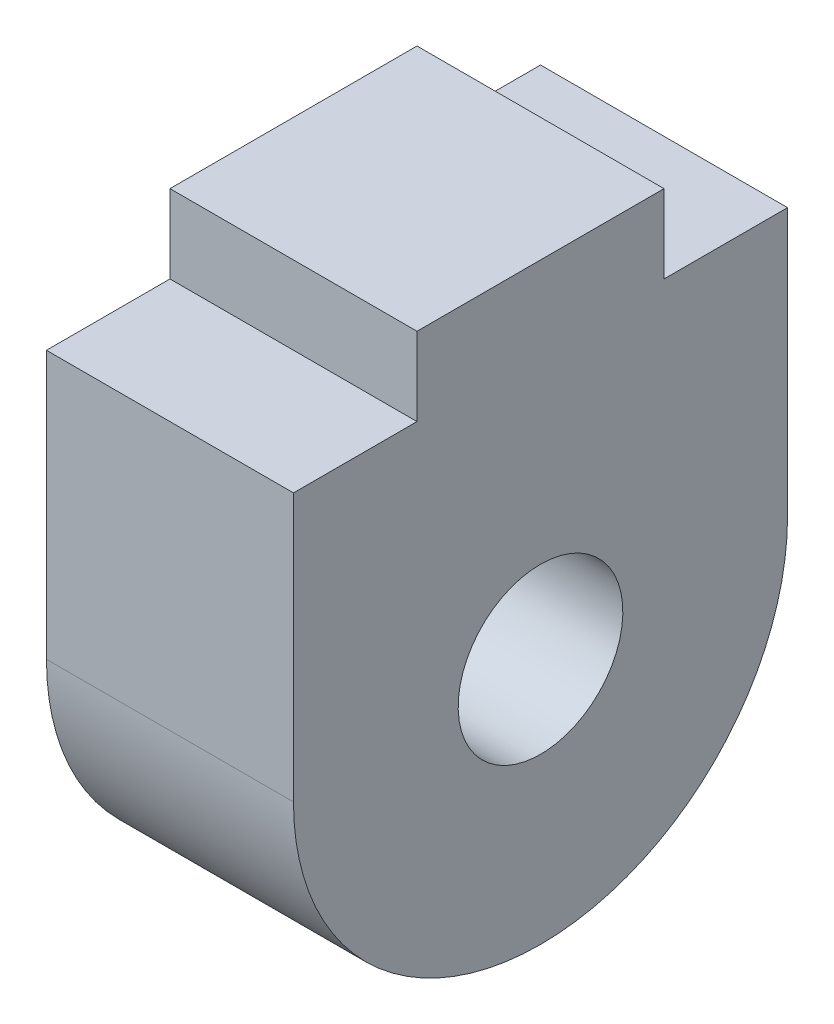
ISO-10303-21;
HEADER;
FILE_DESCRIPTION(('STEP AP214'),'2;1');
FILE_NAME('part.step','',(''),(''),'','','');
FILE_SCHEMA(('AUTOMOTIVE_DESIGN { 1 0 10303 214 1 1 1 1 }'));
ENDSEC;
DATA;
#1=APPLICATION_CONTEXT('core data for automotive mechanical design processes');
#2=APPLICATION_PROTOCOL_DEFINITION('international standard','automotive_design',2000,#1);
#3=PRODUCT_CONTEXT('',#1,'mechanical');
#4=PRODUCT('Part','Part','',(#3));
#5=PRODUCT_RELATED_PRODUCT_CATEGORY('part','',(#4));
#6=PRODUCT_DEFINITION_FORMATION('','',#4);
#7=PRODUCT_DEFINITION_CONTEXT('part definition',#1,'design');
#8=PRODUCT_DEFINITION('design','',#6,#7);
#9=PRODUCT_DEFINITION_SHAPE('','',#8);
#10=(LENGTH_UNIT() NAMED_UNIT(*) SI_UNIT(.MILLI.,.METRE.));
#11=(NAMED_UNIT(*) PLANE_ANGLE_UNIT() SI_UNIT($,.RADIAN.));
#12=(NAMED_UNIT(*) SI_UNIT($,.STERADIAN.) SOLID_ANGLE_UNIT());
#13=UNCERTAINTY_MEASURE_WITH_UNIT(LENGTH_MEASURE(1.E-05),#10,'distance_accuracy_value','');
#14=(GEOMETRIC_REPRESENTATION_CONTEXT(3) GLOBAL_UNCERTAINTY_ASSIGNED_CONTEXT((#13)) GLOBAL_UNIT_ASSIGNED_CONTEXT((#10,
#11,#12)) REPRESENTATION_CONTEXT('',''));
#15=CARTESIAN_POINT('',(0.,0.,0.));
#16=DIRECTION('',(0.,0.,1.));
#17=DIRECTION('',(1.,0.,0.));
#18=AXIS2_PLACEMENT_3D('',#15,#16,#17);
#19=CARTESIAN_POINT('',(0.,6.5,0.));
#20=DIRECTION('',(0.,-1.,0.));
#21=DIRECTION('',(0.,0.,-1.));
#22=AXIS2_PLACEMENT_3D('',#19,#20,#21);
#23=PLANE('',#22);
#24=DIRECTION('',(1.,0.,0.));
#25=VECTOR('',#24,1.);
#26=CARTESIAN_POINT('',(3.,6.5,-89.5));
#27=LINE('',#26,#25);
#28=CARTESIAN_POINT('',(-3.,6.5,-89.5));
#29=VERTEX_POINT('',#28);
#30=CARTESIAN_POINT('',(3.,6.5,-89.5));
#31=VERTEX_POINT('',#30);
#32=EDGE_CURVE('E129',#29,#31,#27,.T.);
#33=ORIENTED_EDGE('',*,*,#32,.F.);
#34=DIRECTION('',(0.,0.,1.));
#35=VECTOR('',#34,1.);
#36=CARTESIAN_POINT('',(-3.,6.49999999999999,0.));
#37=LINE('',#36,#35);
#38=CARTESIAN_POINT('',(-3.,6.5,-86.4999999999999));
#39=VERTEX_POINT('',#38);
#40=EDGE_CURVE('E53',#29,#39,#37,.T.);
#41=ORIENTED_EDGE('',*,*,#40,.T.);
#42=DIRECTION('',(-1.,0.,0.));
#43=VECTOR('',#42,1.);
#44=CARTESIAN_POINT('',(20.3277234511636,6.5,-86.4999999999999));
#45=LINE('',#44,#43);
#46=CARTESIAN_POINT('',(3.,6.5,-86.4999999999999));
#47=VERTEX_POINT('',#46);
#48=EDGE_CURVE('E155',#47,#39,#45,.T.);
#49=ORIENTED_EDGE('',*,*,#48,.F.);
#50=DIRECTION('',(0.,0.,1.));
#51=VECTOR('',#50,1.);
#52=CARTESIAN_POINT('',(3.,6.49999999999999,0.));
#53=LINE('',#52,#51);
#54=EDGE_CURVE('E61',#31,#47,#53,.T.);
#55=ORIENTED_EDGE('',*,*,#54,.F.);
#56=EDGE_LOOP('',(#33,#41,#49,#55));
#57=FACE_BOUND('',#56,.T.);
#58=ADVANCED_FACE('F45',(#57),#23,.F.);
#59=DIRECTION('',(-1.,0.,0.));
#60=VECTOR('',#59,1.);
#61=CARTESIAN_POINT('',(3.,6.5,-95.5));
#62=LINE('',#61,#60);
#63=CARTESIAN_POINT('',(3.,6.5,-95.5));
#64=VERTEX_POINT('',#63);
#65=CARTESIAN_POINT('',(-3.,6.5,-95.5));
#66=VERTEX_POINT('',#65);
#67=EDGE_CURVE('E68',#64,#66,#62,.T.);
#68=ORIENTED_EDGE('',*,*,#67,.F.);
#69=CARTESIAN_POINT('',(3.,6.5,-98.5000000000001));
#70=VERTEX_POINT('',#69);
#71=EDGE_CURVE('E134',#70,#64,#53,.T.);
#72=ORIENTED_EDGE('',*,*,#71,.F.);
#73=DIRECTION('',(-1.,0.,0.));
#74=VECTOR('',#73,1.);
#75=CARTESIAN_POINT('',(20.3277234511636,6.5,-98.5000000000001));
#76=LINE('',#75,#74);
#77=CARTESIAN_POINT('',(-3.,6.5,-98.5000000000001));
#78=VERTEX_POINT('',#77);
#79=EDGE_CURVE('E158',#70,#78,#76,.T.);
#80=ORIENTED_EDGE('',*,*,#79,.T.);
#81=EDGE_CURVE('E11',#78,#66,#37,.T.);
#82=ORIENTED_EDGE('',*,*,#81,.T.);
#83=EDGE_LOOP('',(#68,#72,#80,#82));
#84=FACE_BOUND('',#83,.T.);
#85=ADVANCED_FACE('F204',(#84),#23,.F.);
#86=CARTESIAN_POINT('',(20.3277234511636,0.,-92.5));
#87=DIRECTION('',(-1.,0.,0.));
#88=DIRECTION('',(0.,0.,1.));
#89=AXIS2_PLACEMENT_3D('',#86,#87,#88);
#90=CYLINDRICAL_SURFACE('',#89,2.);
#91=CARTESIAN_POINT('',(3.,0.,-92.5));
#92=DIRECTION('',(1.,0.,0.));
#93=DIRECTION('',(0.,1.,0.));
#94=AXIS2_PLACEMENT_3D('',#91,#92,#93);
#95=CIRCLE('',#94,2.);
#96=CARTESIAN_POINT('',(3.,2.00000000000003,-92.5));
#97=VERTEX_POINT('',#96);
#98=EDGE_CURVE('E152',#97,#97,#95,.T.);
#99=ORIENTED_EDGE('',*,*,#98,.T.);
#100=EDGE_LOOP('',(#99));
#101=FACE_BOUND('',#100,.T.);
#102=CARTESIAN_POINT('',(-3.,0.,-92.5));
#103=DIRECTION('',(-1.,0.,0.));
#104=DIRECTION('',(0.,-1.,0.));
#105=AXIS2_PLACEMENT_3D('',#102,#103,#104);
#106=CIRCLE('',#105,2.);
#107=CARTESIAN_POINT('',(-3.,-1.99999999999996,-92.5));
#108=VERTEX_POINT('',#107);
#109=EDGE_CURVE('E147',#108,#108,#106,.F.);
#110=ORIENTED_EDGE('',*,*,#109,.F.);
#111=EDGE_LOOP('',(#110));
#112=FACE_BOUND('',#111,.T.);
#113=ADVANCED_FACE('F202',(#101,#112),#90,.F.);
#114=CARTESIAN_POINT('',(20.3277234511636,0.,-98.5000000000001));
#115=DIRECTION('',(0.,0.,1.));
#116=DIRECTION('',(1.,0.,0.));
#117=AXIS2_PLACEMENT_3D('',#114,#115,#116);
#118=PLANE('',#117);
#119=DIRECTION('',(0.,1.,0.));
#120=VECTOR('',#119,1.);
#121=CARTESIAN_POINT('',(3.,0.,-98.5000000000001));
#122=LINE('',#121,#120);
#123=CARTESIAN_POINT('',(3.,0.,-98.5000000000001));
#124=VERTEX_POINT('',#123);
#125=EDGE_CURVE('E159',#124,#70,#122,.T.);
#126=ORIENTED_EDGE('',*,*,#125,.F.);
#127=DIRECTION('',(-1.,0.,0.));
#128=VECTOR('',#127,1.);
#129=CARTESIAN_POINT('',(20.3277234511636,0.,-98.5000000000001));
#130=LINE('',#129,#128);
#131=CARTESIAN_POINT('',(-3.,0.,-98.5000000000001));
#132=VERTEX_POINT('',#131);
#133=EDGE_CURVE('E156',#124,#132,#130,.T.);
#134=ORIENTED_EDGE('',*,*,#133,.T.);
#135=DIRECTION('',(0.,1.,0.));
#136=VECTOR('',#135,1.);
#137=CARTESIAN_POINT('',(-3.,0.,-98.5000000000001));
#138=LINE('',#137,#136);
#139=EDGE_CURVE('E146',#132,#78,#138,.T.);
#140=ORIENTED_EDGE('',*,*,#139,.T.);
#141=ORIENTED_EDGE('',*,*,#79,.F.);
#142=EDGE_LOOP('',(#126,#134,#140,#141));
#143=FACE_BOUND('',#142,.T.);
#144=ADVANCED_FACE('F213',(#143),#118,.F.);
#145=CARTESIAN_POINT('',(20.3277234511636,-1.84681330057839E-13,-86.4999999999999));
#146=DIRECTION('',(0.,0.,-1.));
#147=DIRECTION('',(0.,1.,0.));
#148=AXIS2_PLACEMENT_3D('',#145,#146,#147);
#149=PLANE('',#148);
#150=DIRECTION('',(0.,-1.,0.));
#151=VECTOR('',#150,1.);
#152=CARTESIAN_POINT('',(3.,-1.84681326707616E-13,-86.4999999999999));
#153=LINE('',#152,#151);
#154=CARTESIAN_POINT('',(3.,0.,-86.4999999999999));
#155=VERTEX_POINT('',#154);
#156=EDGE_CURVE('E164',#47,#155,#153,.T.);
#157=ORIENTED_EDGE('',*,*,#156,.F.);
#158=ORIENTED_EDGE('',*,*,#48,.T.);
#159=DIRECTION('',(0.,-1.,0.));
#160=VECTOR('',#159,1.);
#161=CARTESIAN_POINT('',(-3.,-1.84681333408062E-13,-86.4999999999999));
#162=LINE('',#161,#160);
#163=CARTESIAN_POINT('',(-3.,0.,-86.4999999999999));
#164=VERTEX_POINT('',#163);
#165=EDGE_CURVE('E135',#39,#164,#162,.T.);
#166=ORIENTED_EDGE('',*,*,#165,.T.);
#167=DIRECTION('',(-1.,0.,0.));
#168=VECTOR('',#167,1.);
#169=CARTESIAN_POINT('',(20.3277234511636,0.,-86.4999999999999));
#170=LINE('',#169,#168);
#171=EDGE_CURVE('E48',#155,#164,#170,.T.);
#172=ORIENTED_EDGE('',*,*,#171,.F.);
#173=EDGE_LOOP('',(#157,#158,#166,#172));
#174=FACE_BOUND('',#173,.T.);
#175=ADVANCED_FACE('F172',(#174),#149,.F.);
#176=CARTESIAN_POINT('',(20.3277234511636,0.,-92.5));
#177=DIRECTION('',(-1.,0.,0.));
#178=DIRECTION('',(0.,0.,1.));
#179=AXIS2_PLACEMENT_3D('',#176,#177,#178);
#180=CYLINDRICAL_SURFACE('',#179,6.00000000000009);
#181=CARTESIAN_POINT('',(3.,0.,-92.5));
#182=DIRECTION('',(1.,0.,0.));
#183=DIRECTION('',(0.,1.,0.));
#184=AXIS2_PLACEMENT_3D('',#181,#182,#183);
#185=CIRCLE('',#184,6.00000000000009);
#186=EDGE_CURVE('E161',#155,#124,#185,.T.);
#187=ORIENTED_EDGE('',*,*,#186,.F.);
#188=ORIENTED_EDGE('',*,*,#171,.T.);
#189=CARTESIAN_POINT('',(-3.,0.,-92.5));
#190=DIRECTION('',(-1.,0.,0.));
#191=DIRECTION('',(0.,-1.,0.));
#192=AXIS2_PLACEMENT_3D('',#189,#190,#191);
#193=CIRCLE('',#192,6.00000000000009);
#194=EDGE_CURVE('E138',#164,#132,#193,.F.);
#195=ORIENTED_EDGE('',*,*,#194,.T.);
#196=ORIENTED_EDGE('',*,*,#133,.F.);
#197=EDGE_LOOP('',(#187,#188,#195,#196));
#198=FACE_BOUND('',#197,.T.);
#199=ADVANCED_FACE('F184',(#198),#180,.T.);
#200=CARTESIAN_POINT('',(-3.,-108.342189385777,-73.4744908321675));
#201=DIRECTION('',(-1.,0.,0.));
#202=DIRECTION('',(0.,0.984928994416215,-0.172959174252955));
#203=AXIS2_PLACEMENT_3D('',#200,#201,#202);
#204=PLANE('',#203);
#205=ORIENTED_EDGE('',*,*,#194,.F.);
#206=ORIENTED_EDGE('',*,*,#165,.F.);
#207=ORIENTED_EDGE('',*,*,#40,.F.);
#208=DIRECTION('',(0.,-1.,0.));
#209=VECTOR('',#208,1.);
#210=CARTESIAN_POINT('',(-3.,8.4,-89.5));
#211=LINE('',#210,#209);
#212=CARTESIAN_POINT('',(-3.,8.4,-89.5));
#213=VERTEX_POINT('',#212);
#214=EDGE_CURVE('E140',#213,#29,#211,.T.);
#215=ORIENTED_EDGE('',*,*,#214,.F.);
#216=DIRECTION('',(0.,0.,1.));
#217=VECTOR('',#216,1.);
#218=CARTESIAN_POINT('',(-3.,8.4,-89.5));
#219=LINE('',#218,#217);
#220=CARTESIAN_POINT('',(-3.,8.4,-95.5));
#221=VERTEX_POINT('',#220);
#222=EDGE_CURVE('E119',#221,#213,#219,.T.);
#223=ORIENTED_EDGE('',*,*,#222,.F.);
#224=DIRECTION('',(0.,-1.,0.));
#225=VECTOR('',#224,1.);
#226=CARTESIAN_POINT('',(-3.,8.4,-95.5));
#227=LINE('',#226,#225);
#228=EDGE_CURVE('E116',#221,#66,#227,.T.);
#229=ORIENTED_EDGE('',*,*,#228,.T.);
#230=ORIENTED_EDGE('',*,*,#81,.F.);
#231=ORIENTED_EDGE('',*,*,#139,.F.);
#232=EDGE_LOOP('',(#205,#206,#207,#215,#223,#229,#230,#231));
#233=FACE_BOUND('',#232,.T.);
#234=ORIENTED_EDGE('',*,*,#109,.T.);
#235=EDGE_LOOP('',(#234));
#236=FACE_BOUND('',#235,.T.);
#237=ADVANCED_FACE('F176',(#233,#236),#204,.T.);
#238=CARTESIAN_POINT('',(3.,-108.342189385777,-73.4744908321675));
#239=DIRECTION('',(1.,0.,0.));
#240=DIRECTION('',(0.,0.984928994416215,-0.172959174252955));
#241=AXIS2_PLACEMENT_3D('',#238,#239,#240);
#242=PLANE('',#241);
#243=ORIENTED_EDGE('',*,*,#98,.F.);
#244=EDGE_LOOP('',(#243));
#245=FACE_BOUND('',#244,.T.);
#246=ORIENTED_EDGE('',*,*,#156,.T.);
#247=ORIENTED_EDGE('',*,*,#186,.T.);
#248=ORIENTED_EDGE('',*,*,#125,.T.);
#249=ORIENTED_EDGE('',*,*,#71,.T.);
#250=DIRECTION('',(0.,-1.,0.));
#251=VECTOR('',#250,1.);
#252=CARTESIAN_POINT('',(3.,8.4,-95.5));
#253=LINE('',#252,#251);
#254=CARTESIAN_POINT('',(3.,8.4,-95.5));
#255=VERTEX_POINT('',#254);
#256=EDGE_CURVE('E114',#255,#64,#253,.T.);
#257=ORIENTED_EDGE('',*,*,#256,.F.);
#258=DIRECTION('',(0.,0.,-1.));
#259=VECTOR('',#258,1.);
#260=CARTESIAN_POINT('',(3.,8.4,-89.5));
#261=LINE('',#260,#259);
#262=CARTESIAN_POINT('',(3.,8.4,-89.5));
#263=VERTEX_POINT('',#262);
#264=EDGE_CURVE('E120',#263,#255,#261,.T.);
#265=ORIENTED_EDGE('',*,*,#264,.F.);
#266=DIRECTION('',(0.,-1.,0.));
#267=VECTOR('',#266,1.);
#268=CARTESIAN_POINT('',(3.,8.4,-89.5));
#269=LINE('',#268,#267);
#270=EDGE_CURVE('E185',#263,#31,#269,.T.);
#271=ORIENTED_EDGE('',*,*,#270,.T.);
#272=ORIENTED_EDGE('',*,*,#54,.T.);
#273=EDGE_LOOP('',(#246,#247,#248,#249,#257,#265,#271,#272));
#274=FACE_BOUND('',#273,.T.);
#275=ADVANCED_FACE('F132',(#245,#274),#242,.T.);
#276=CARTESIAN_POINT('',(3.,8.4,-95.5));
#277=DIRECTION('',(0.,0.,1.));
#278=DIRECTION('',(1.,0.,0.));
#279=AXIS2_PLACEMENT_3D('',#276,#277,#278);
#280=PLANE('',#279);
#281=ORIENTED_EDGE('',*,*,#67,.T.);
#282=ORIENTED_EDGE('',*,*,#228,.F.);
#283=DIRECTION('',(-1.,0.,0.));
#284=VECTOR('',#283,1.);
#285=CARTESIAN_POINT('',(3.,8.4,-95.5));
#286=LINE('',#285,#284);
#287=EDGE_CURVE('E110',#255,#221,#286,.T.);
#288=ORIENTED_EDGE('',*,*,#287,.F.);
#289=ORIENTED_EDGE('',*,*,#256,.T.);
#290=EDGE_LOOP('',(#281,#282,#288,#289));
#291=FACE_BOUND('',#290,.T.);
#292=ADVANCED_FACE('F112',(#291),#280,.F.);
#293=CARTESIAN_POINT('',(3.,8.4,-89.5));
#294=DIRECTION('',(0.,0.,-1.));
#295=DIRECTION('',(-1.,0.,0.));
#296=AXIS2_PLACEMENT_3D('',#293,#294,#295);
#297=PLANE('',#296);
#298=ORIENTED_EDGE('',*,*,#32,.T.);
#299=ORIENTED_EDGE('',*,*,#270,.F.);
#300=DIRECTION('',(1.,0.,0.));
#301=VECTOR('',#300,1.);
#302=CARTESIAN_POINT('',(3.,8.4,-89.5));
#303=LINE('',#302,#301);
#304=EDGE_CURVE('E125',#213,#263,#303,.T.);
#305=ORIENTED_EDGE('',*,*,#304,.F.);
#306=ORIENTED_EDGE('',*,*,#214,.T.);
#307=EDGE_LOOP('',(#298,#299,#305,#306));
#308=FACE_BOUND('',#307,.T.);
#309=ADVANCED_FACE('F192',(#308),#297,.F.);
#310=CARTESIAN_POINT('',(0.,8.4,0.));
#311=DIRECTION('',(0.,1.,0.));
#312=DIRECTION('',(0.,0.,1.));
#313=AXIS2_PLACEMENT_3D('',#310,#311,#312);
#314=PLANE('',#313);
#315=ORIENTED_EDGE('',*,*,#264,.T.);
#316=ORIENTED_EDGE('',*,*,#287,.T.);
#317=ORIENTED_EDGE('',*,*,#222,.T.);
#318=ORIENTED_EDGE('',*,*,#304,.T.);
#319=EDGE_LOOP('',(#315,#316,#317,#318));
#320=FACE_BOUND('',#319,.T.);
#321=ADVANCED_FACE('F123',(#320),#314,.T.);
#322=CLOSED_SHELL('',(#58,#85,#113,#144,#175,#199,#237,#275,#292,#309,#321));
#323=MANIFOLD_SOLID_BREP('B2',#322);
#324=ADVANCED_BREP_SHAPE_REPRESENTATION('',(#18,#323),#14);
#325=SHAPE_DEFINITION_REPRESENTATION(#9,#324);
ENDSEC;
END-ISO-10303-21;
